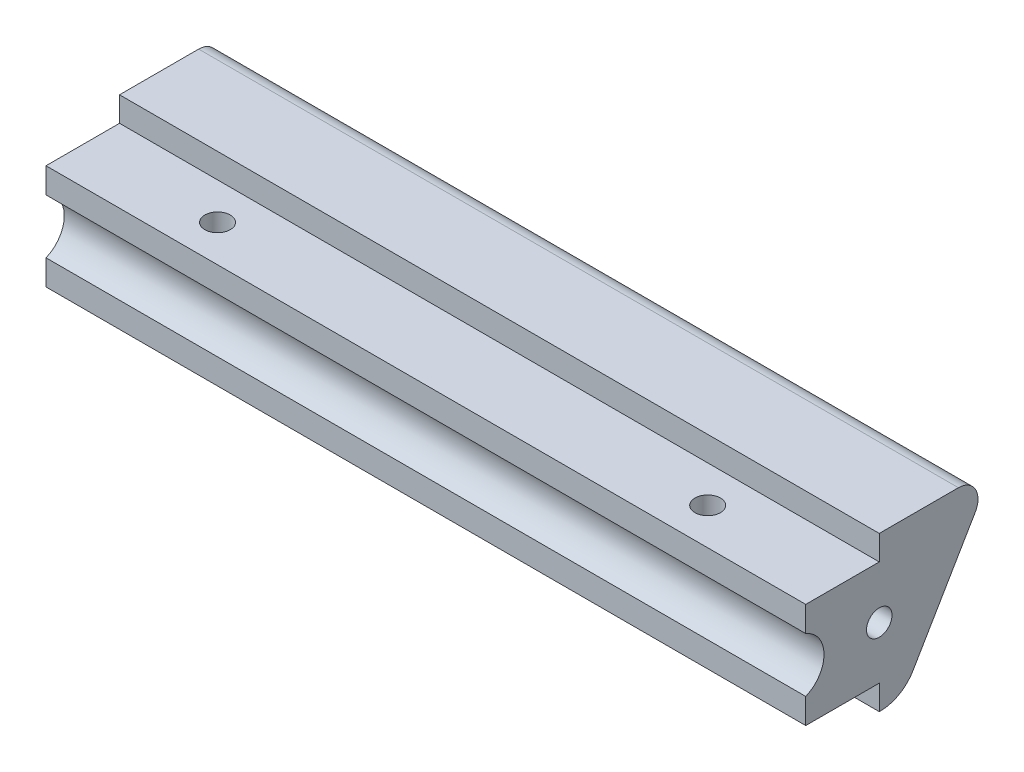
ISO-10303-21;
HEADER;
FILE_DESCRIPTION(('STEP AP214'),'2;1');
FILE_NAME('part.step','',(''),(''),'','','');
FILE_SCHEMA(('AUTOMOTIVE_DESIGN { 1 0 10303 214 1 1 1 1 }'));
ENDSEC;
DATA;
#1=APPLICATION_CONTEXT('core data for automotive mechanical design processes');
#2=APPLICATION_PROTOCOL_DEFINITION('international standard','automotive_design',2000,#1);
#3=PRODUCT_CONTEXT('',#1,'mechanical');
#4=PRODUCT('Part','Part','',(#3));
#5=PRODUCT_RELATED_PRODUCT_CATEGORY('part','',(#4));
#6=PRODUCT_DEFINITION_FORMATION('','',#4);
#7=PRODUCT_DEFINITION_CONTEXT('part definition',#1,'design');
#8=PRODUCT_DEFINITION('design','',#6,#7);
#9=PRODUCT_DEFINITION_SHAPE('','',#8);
#10=(LENGTH_UNIT() NAMED_UNIT(*) SI_UNIT(.MILLI.,.METRE.));
#11=(NAMED_UNIT(*) PLANE_ANGLE_UNIT() SI_UNIT($,.RADIAN.));
#12=(NAMED_UNIT(*) SI_UNIT($,.STERADIAN.) SOLID_ANGLE_UNIT());
#13=UNCERTAINTY_MEASURE_WITH_UNIT(LENGTH_MEASURE(1.E-05),#10,'distance_accuracy_value','');
#14=(GEOMETRIC_REPRESENTATION_CONTEXT(3) GLOBAL_UNCERTAINTY_ASSIGNED_CONTEXT((#13)) GLOBAL_UNIT_ASSIGNED_CONTEXT((#10,
#11,#12)) REPRESENTATION_CONTEXT('',''));
#15=CARTESIAN_POINT('',(0.,0.,0.));
#16=DIRECTION('',(0.,0.,1.));
#17=DIRECTION('',(1.,0.,0.));
#18=AXIS2_PLACEMENT_3D('',#15,#16,#17);
#19=CARTESIAN_POINT('',(98.425,16.7996,0.));
#20=DIRECTION('',(0.,0.,-1.));
#21=DIRECTION('',(0.,1.,0.));
#22=AXIS2_PLACEMENT_3D('',#19,#20,#21);
#23=PLANE('',#22);
#24=DIRECTION('',(0.,-1.,0.));
#25=VECTOR('',#24,1.);
#26=CARTESIAN_POINT('',(98.425,16.7996,0.));
#27=LINE('',#26,#25);
#28=CARTESIAN_POINT('',(98.425,6.4737188141613,0.));
#29=VERTEX_POINT('',#28);
#30=CARTESIAN_POINT('',(98.425,3.2004,0.));
#31=VERTEX_POINT('',#30);
#32=EDGE_CURVE('E137',#29,#31,#27,.T.);
#33=ORIENTED_EDGE('',*,*,#32,.F.);
#34=DIRECTION('',(-1.,0.,0.));
#35=VECTOR('',#34,1.);
#36=CARTESIAN_POINT('',(105.864264117156,6.4737188141613,0.));
#37=LINE('',#36,#35);
#38=CARTESIAN_POINT('',(0.,6.4737188141613,0.));
#39=VERTEX_POINT('',#38);
#40=EDGE_CURVE('E123',#29,#39,#37,.T.);
#41=ORIENTED_EDGE('',*,*,#40,.T.);
#42=DIRECTION('',(0.,-1.,0.));
#43=VECTOR('',#42,1.);
#44=CARTESIAN_POINT('',(0.,16.7996,0.));
#45=LINE('',#44,#43);
#46=CARTESIAN_POINT('',(0.,3.2004,0.));
#47=VERTEX_POINT('',#46);
#48=EDGE_CURVE('E135',#39,#47,#45,.T.);
#49=ORIENTED_EDGE('',*,*,#48,.T.);
#50=DIRECTION('',(-1.,0.,0.));
#51=VECTOR('',#50,1.);
#52=CARTESIAN_POINT('',(98.425,3.2004,0.));
#53=LINE('',#52,#51);
#54=EDGE_CURVE('E173',#31,#47,#53,.T.);
#55=ORIENTED_EDGE('',*,*,#54,.F.);
#56=EDGE_LOOP('',(#33,#41,#49,#55));
#57=FACE_BOUND('',#56,.T.);
#58=ADVANCED_FACE('F32',(#57),#23,.F.);
#59=CARTESIAN_POINT('',(98.425,20.,-24.2156234533446));
#60=DIRECTION('',(0.,-1.,0.));
#61=DIRECTION('',(0.,0.,-1.));
#62=AXIS2_PLACEMENT_3D('',#59,#60,#61);
#63=PLANE('',#62);
#64=DIRECTION('',(0.,0.,1.));
#65=VECTOR('',#64,1.);
#66=CARTESIAN_POINT('',(98.425,20.,-24.2156234533446));
#67=LINE('',#66,#65);
#68=CARTESIAN_POINT('',(98.425,20.,-19.7792045559382));
#69=VERTEX_POINT('',#68);
#70=CARTESIAN_POINT('',(98.425,20.,-9.525));
#71=VERTEX_POINT('',#70);
#72=EDGE_CURVE('E159',#69,#71,#67,.T.);
#73=ORIENTED_EDGE('',*,*,#72,.F.);
#74=DIRECTION('',(-1.,0.,0.));
#75=VECTOR('',#74,1.);
#76=CARTESIAN_POINT('',(98.425,20.,-19.7792045559382));
#77=LINE('',#76,#75);
#78=CARTESIAN_POINT('',(0.,20.,-19.7792045559382));
#79=VERTEX_POINT('',#78);
#80=EDGE_CURVE('E184',#69,#79,#77,.T.);
#81=ORIENTED_EDGE('',*,*,#80,.T.);
#82=DIRECTION('',(0.,0.,1.));
#83=VECTOR('',#82,1.);
#84=CARTESIAN_POINT('',(0.,20.,-24.2156234533446));
#85=LINE('',#84,#83);
#86=CARTESIAN_POINT('',(0.,20.,-9.525));
#87=VERTEX_POINT('',#86);
#88=EDGE_CURVE('E192',#79,#87,#85,.T.);
#89=ORIENTED_EDGE('',*,*,#88,.T.);
#90=DIRECTION('',(-1.,0.,0.));
#91=VECTOR('',#90,1.);
#92=CARTESIAN_POINT('',(98.425,20.,-9.525));
#93=LINE('',#92,#91);
#94=EDGE_CURVE('E181',#71,#87,#93,.T.);
#95=ORIENTED_EDGE('',*,*,#94,.F.);
#96=EDGE_LOOP('',(#73,#81,#89,#95));
#97=FACE_BOUND('',#96,.T.);
#98=ADVANCED_FACE('F190',(#97),#63,.F.);
#99=CARTESIAN_POINT('',(98.425,20.,-9.525));
#100=DIRECTION('',(0.,0.,-1.));
#101=DIRECTION('',(-1.,0.,0.));
#102=AXIS2_PLACEMENT_3D('',#99,#100,#101);
#103=PLANE('',#102);
#104=DIRECTION('',(0.,-1.,0.));
#105=VECTOR('',#104,1.);
#106=CARTESIAN_POINT('',(0.,20.,-9.525));
#107=LINE('',#106,#105);
#108=CARTESIAN_POINT('',(0.,16.7996,-9.525));
#109=VERTEX_POINT('',#108);
#110=EDGE_CURVE('E146',#87,#109,#107,.T.);
#111=ORIENTED_EDGE('',*,*,#110,.T.);
#112=DIRECTION('',(-1.,0.,0.));
#113=VECTOR('',#112,1.);
#114=CARTESIAN_POINT('',(98.425,16.7996,-9.525));
#115=LINE('',#114,#113);
#116=CARTESIAN_POINT('',(98.425,16.7996,-9.525));
#117=VERTEX_POINT('',#116);
#118=EDGE_CURVE('E178',#117,#109,#115,.T.);
#119=ORIENTED_EDGE('',*,*,#118,.F.);
#120=DIRECTION('',(0.,-1.,0.));
#121=VECTOR('',#120,1.);
#122=CARTESIAN_POINT('',(98.425,20.,-9.525));
#123=LINE('',#122,#121);
#124=EDGE_CURVE('E215',#71,#117,#123,.T.);
#125=ORIENTED_EDGE('',*,*,#124,.F.);
#126=ORIENTED_EDGE('',*,*,#94,.T.);
#127=EDGE_LOOP('',(#111,#119,#125,#126));
#128=FACE_BOUND('',#127,.T.);
#129=ADVANCED_FACE('F263',(#128),#103,.F.);
#130=CARTESIAN_POINT('',(98.425,16.7996,-9.525));
#131=DIRECTION('',(0.,-1.,0.));
#132=DIRECTION('',(0.,0.,-1.));
#133=AXIS2_PLACEMENT_3D('',#130,#131,#132);
#134=PLANE('',#133);
#135=CARTESIAN_POINT('',(17.4625,16.7996,-4.76250000000001));
#136=DIRECTION('',(0.,1.,0.));
#137=DIRECTION('',(0.,0.,1.));
#138=AXIS2_PLACEMENT_3D('',#135,#136,#137);
#139=CIRCLE('',#138,1.651);
#140=CARTESIAN_POINT('',(17.4625,16.7996,-3.11150000000001));
#141=VERTEX_POINT('',#140);
#142=EDGE_CURVE('E222',#141,#141,#139,.T.);
#143=ORIENTED_EDGE('',*,*,#142,.F.);
#144=EDGE_LOOP('',(#143));
#145=FACE_BOUND('',#144,.T.);
#146=CARTESIAN_POINT('',(80.9625,16.7996,-4.76250000000005));
#147=DIRECTION('',(0.,1.,0.));
#148=DIRECTION('',(0.,0.,1.));
#149=AXIS2_PLACEMENT_3D('',#146,#147,#148);
#150=CIRCLE('',#149,1.65100000000001);
#151=CARTESIAN_POINT('',(80.9625,16.7996,-3.11150000000004));
#152=VERTEX_POINT('',#151);
#153=EDGE_CURVE('E223',#152,#152,#150,.T.);
#154=ORIENTED_EDGE('',*,*,#153,.F.);
#155=EDGE_LOOP('',(#154));
#156=FACE_BOUND('',#155,.T.);
#157=DIRECTION('',(0.,0.,1.));
#158=VECTOR('',#157,1.);
#159=CARTESIAN_POINT('',(0.,16.7996,-9.525));
#160=LINE('',#159,#158);
#161=CARTESIAN_POINT('',(0.,16.7996,0.));
#162=VERTEX_POINT('',#161);
#163=EDGE_CURVE('E144',#109,#162,#160,.T.);
#164=ORIENTED_EDGE('',*,*,#163,.T.);
#165=DIRECTION('',(-1.,0.,0.));
#166=VECTOR('',#165,1.);
#167=CARTESIAN_POINT('',(98.425,16.7996,0.));
#168=LINE('',#167,#166);
#169=CARTESIAN_POINT('',(98.425,16.7996,0.));
#170=VERTEX_POINT('',#169);
#171=EDGE_CURVE('E175',#170,#162,#168,.T.);
#172=ORIENTED_EDGE('',*,*,#171,.F.);
#173=DIRECTION('',(0.,0.,1.));
#174=VECTOR('',#173,1.);
#175=CARTESIAN_POINT('',(98.425,16.7996,-9.525));
#176=LINE('',#175,#174);
#177=EDGE_CURVE('E213',#117,#170,#176,.T.);
#178=ORIENTED_EDGE('',*,*,#177,.F.);
#179=ORIENTED_EDGE('',*,*,#118,.T.);
#180=EDGE_LOOP('',(#164,#172,#178,#179));
#181=FACE_BOUND('',#180,.T.);
#182=ADVANCED_FACE('F268',(#145,#156,#181),#134,.F.);
#183=CARTESIAN_POINT('',(0.,13.5262811858387,0.));
#184=VERTEX_POINT('',#183);
#185=EDGE_CURVE('E143',#162,#184,#45,.T.);
#186=ORIENTED_EDGE('',*,*,#185,.T.);
#187=DIRECTION('',(-1.,0.,0.));
#188=VECTOR('',#187,1.);
#189=CARTESIAN_POINT('',(105.864264117156,13.5262811858387,0.));
#190=LINE('',#189,#188);
#191=CARTESIAN_POINT('',(98.425,13.5262811858387,0.));
#192=VERTEX_POINT('',#191);
#193=EDGE_CURVE('E126',#192,#184,#190,.T.);
#194=ORIENTED_EDGE('',*,*,#193,.F.);
#195=EDGE_CURVE('E210',#170,#192,#27,.T.);
#196=ORIENTED_EDGE('',*,*,#195,.F.);
#197=ORIENTED_EDGE('',*,*,#171,.T.);
#198=EDGE_LOOP('',(#186,#194,#196,#197));
#199=FACE_BOUND('',#198,.T.);
#200=ADVANCED_FACE('F259',(#199),#23,.F.);
#201=CARTESIAN_POINT('',(98.425,3.2004,0.));
#202=DIRECTION('',(0.,1.,0.));
#203=DIRECTION('',(0.,0.,1.));
#204=AXIS2_PLACEMENT_3D('',#201,#202,#203);
#205=PLANE('',#204);
#206=CARTESIAN_POINT('',(17.4625,3.2004,-4.76250000000001));
#207=DIRECTION('',(0.,1.,0.));
#208=DIRECTION('',(0.,0.,1.));
#209=AXIS2_PLACEMENT_3D('',#206,#207,#208);
#210=CIRCLE('',#209,1.651);
#211=CARTESIAN_POINT('',(17.4625,3.2004,-3.11150000000001));
#212=VERTEX_POINT('',#211);
#213=EDGE_CURVE('E130',#212,#212,#210,.F.);
#214=ORIENTED_EDGE('',*,*,#213,.F.);
#215=EDGE_LOOP('',(#214));
#216=FACE_BOUND('',#215,.T.);
#217=CARTESIAN_POINT('',(80.9625,3.2004,-4.76250000000005));
#218=DIRECTION('',(0.,1.,0.));
#219=DIRECTION('',(0.,0.,1.));
#220=AXIS2_PLACEMENT_3D('',#217,#218,#219);
#221=CIRCLE('',#220,1.65100000000001);
#222=CARTESIAN_POINT('',(80.9625,3.2004,-3.11150000000005));
#223=VERTEX_POINT('',#222);
#224=EDGE_CURVE('E219',#223,#223,#221,.F.);
#225=ORIENTED_EDGE('',*,*,#224,.F.);
#226=EDGE_LOOP('',(#225));
#227=FACE_BOUND('',#226,.T.);
#228=DIRECTION('',(0.,0.,-1.));
#229=VECTOR('',#228,1.);
#230=CARTESIAN_POINT('',(0.,3.2004,0.));
#231=LINE('',#230,#229);
#232=CARTESIAN_POINT('',(0.,3.2004,-9.525));
#233=VERTEX_POINT('',#232);
#234=EDGE_CURVE('E142',#47,#233,#231,.T.);
#235=ORIENTED_EDGE('',*,*,#234,.T.);
#236=DIRECTION('',(-1.,0.,0.));
#237=VECTOR('',#236,1.);
#238=CARTESIAN_POINT('',(98.425,3.2004,-9.525));
#239=LINE('',#238,#237);
#240=CARTESIAN_POINT('',(98.425,3.2004,-9.525));
#241=VERTEX_POINT('',#240);
#242=EDGE_CURVE('E170',#241,#233,#239,.T.);
#243=ORIENTED_EDGE('',*,*,#242,.F.);
#244=DIRECTION('',(0.,0.,-1.));
#245=VECTOR('',#244,1.);
#246=CARTESIAN_POINT('',(98.425,3.2004,0.));
#247=LINE('',#246,#245);
#248=EDGE_CURVE('E208',#31,#241,#247,.T.);
#249=ORIENTED_EDGE('',*,*,#248,.F.);
#250=ORIENTED_EDGE('',*,*,#54,.T.);
#251=EDGE_LOOP('',(#235,#243,#249,#250));
#252=FACE_BOUND('',#251,.T.);
#253=ADVANCED_FACE('F267',(#216,#227,#252),#205,.F.);
#254=CARTESIAN_POINT('',(98.425,3.2004,-9.525));
#255=DIRECTION('',(0.,0.,-1.));
#256=DIRECTION('',(0.,1.,0.));
#257=AXIS2_PLACEMENT_3D('',#254,#255,#256);
#258=PLANE('',#257);
#259=DIRECTION('',(0.,-1.,0.));
#260=VECTOR('',#259,1.);
#261=CARTESIAN_POINT('',(0.,3.2004,-9.525));
#262=LINE('',#261,#260);
#263=CARTESIAN_POINT('',(0.,0.,-9.525));
#264=VERTEX_POINT('',#263);
#265=EDGE_CURVE('E151',#233,#264,#262,.T.);
#266=ORIENTED_EDGE('',*,*,#265,.T.);
#267=DIRECTION('',(-1.,0.,0.));
#268=VECTOR('',#267,1.);
#269=CARTESIAN_POINT('',(98.425,0.,-9.525));
#270=LINE('',#269,#268);
#271=CARTESIAN_POINT('',(98.425,0.,-9.525));
#272=VERTEX_POINT('',#271);
#273=EDGE_CURVE('E167',#272,#264,#270,.T.);
#274=ORIENTED_EDGE('',*,*,#273,.F.);
#275=DIRECTION('',(0.,-1.,0.));
#276=VECTOR('',#275,1.);
#277=CARTESIAN_POINT('',(98.425,3.2004,-9.525));
#278=LINE('',#277,#276);
#279=EDGE_CURVE('E206',#241,#272,#278,.T.);
#280=ORIENTED_EDGE('',*,*,#279,.F.);
#281=ORIENTED_EDGE('',*,*,#242,.T.);
#282=EDGE_LOOP('',(#266,#274,#280,#281));
#283=FACE_BOUND('',#282,.T.);
#284=ADVANCED_FACE('F274',(#283),#258,.F.);
#285=CARTESIAN_POINT('',(98.425,0.,-9.67200120834093));
#286=DIRECTION('',(0.,1.,0.));
#287=DIRECTION('',(0.,0.,1.));
#288=AXIS2_PLACEMENT_3D('',#285,#286,#287);
#289=PLANE('',#288);
#290=DIRECTION('',(0.,0.,-1.));
#291=VECTOR('',#290,1.);
#292=CARTESIAN_POINT('',(0.,0.,-9.67200120834093));
#293=LINE('',#292,#291);
#294=CARTESIAN_POINT('',(0.,0.,-9.67200120834093));
#295=VERTEX_POINT('',#294);
#296=EDGE_CURVE('E153',#264,#295,#293,.T.);
#297=ORIENTED_EDGE('',*,*,#296,.T.);
#298=DIRECTION('',(-1.,0.,0.));
#299=VECTOR('',#298,1.);
#300=CARTESIAN_POINT('',(98.425,0.,-9.67200120834093));
#301=LINE('',#300,#299);
#302=CARTESIAN_POINT('',(98.425,0.,-9.67200120834093));
#303=VERTEX_POINT('',#302);
#304=EDGE_CURVE('E163',#303,#295,#301,.T.);
#305=ORIENTED_EDGE('',*,*,#304,.F.);
#306=DIRECTION('',(0.,0.,-1.));
#307=VECTOR('',#306,1.);
#308=CARTESIAN_POINT('',(98.425,0.,-9.67200120834093));
#309=LINE('',#308,#307);
#310=EDGE_CURVE('E204',#272,#303,#309,.T.);
#311=ORIENTED_EDGE('',*,*,#310,.F.);
#312=ORIENTED_EDGE('',*,*,#273,.T.);
#313=EDGE_LOOP('',(#297,#305,#311,#312));
#314=FACE_BOUND('',#313,.T.);
#315=ADVANCED_FACE('F293',(#314),#289,.F.);
#316=CARTESIAN_POINT('',(98.425,4.89533435134192,-9.67200120834093));
#317=DIRECTION('',(-1.,0.,0.));
#318=DIRECTION('',(0.,0.,1.));
#319=AXIS2_PLACEMENT_3D('',#316,#317,#318);
#320=CYLINDRICAL_SURFACE('',#319,4.89533435134192);
#321=CARTESIAN_POINT('',(0.,4.89533435134192,-9.67200120834093));
#322=DIRECTION('',(1.,0.,0.));
#323=DIRECTION('',(0.,0.,1.));
#324=AXIS2_PLACEMENT_3D('',#321,#322,#323);
#325=CIRCLE('',#324,4.89533435134192);
#326=CARTESIAN_POINT('',(0.,2.4170390254288,-13.893653809987));
#327=VERTEX_POINT('',#326);
#328=EDGE_CURVE('E155',#295,#327,#325,.T.);
#329=ORIENTED_EDGE('',*,*,#328,.T.);
#330=DIRECTION('',(-1.,0.,0.));
#331=VECTOR('',#330,1.);
#332=CARTESIAN_POINT('',(98.425,2.4170390254288,-13.893653809987));
#333=LINE('',#332,#331);
#334=CARTESIAN_POINT('',(98.425,2.4170390254288,-13.893653809987));
#335=VERTEX_POINT('',#334);
#336=EDGE_CURVE('E160',#335,#327,#333,.T.);
#337=ORIENTED_EDGE('',*,*,#336,.F.);
#338=CARTESIAN_POINT('',(98.425,4.89533435134192,-9.67200120834093));
#339=DIRECTION('',(1.,0.,0.));
#340=DIRECTION('',(0.,0.,1.));
#341=AXIS2_PLACEMENT_3D('',#338,#339,#340);
#342=CIRCLE('',#341,4.89533435134192);
#343=EDGE_CURVE('E202',#303,#335,#342,.T.);
#344=ORIENTED_EDGE('',*,*,#343,.F.);
#345=ORIENTED_EDGE('',*,*,#304,.T.);
#346=EDGE_LOOP('',(#329,#337,#344,#345));
#347=FACE_BOUND('',#346,.T.);
#348=ADVANCED_FACE('F297',(#347),#320,.T.);
#349=CARTESIAN_POINT('',(98.425,20.,-24.2156234533446));
#350=DIRECTION('',(0.,0.506256600273639,0.862382893313276));
#351=DIRECTION('',(0.,-0.862382893313276,0.506256600273639));
#352=AXIS2_PLACEMENT_3D('',#349,#350,#351);
#353=PLANE('',#352);
#354=DIRECTION('',(0.,0.862382893313276,-0.506256600273639));
#355=VECTOR('',#354,1.);
#356=CARTESIAN_POINT('',(0.,20.,-24.2156234533446));
#357=LINE('',#356,#355);
#358=CARTESIAN_POINT('',(0.,16.174108235305,-21.9696571049539));
#359=VERTEX_POINT('',#358);
#360=EDGE_CURVE('E157',#327,#359,#357,.T.);
#361=ORIENTED_EDGE('',*,*,#360,.T.);
#362=DIRECTION('',(-1.,0.,0.));
#363=VECTOR('',#362,1.);
#364=CARTESIAN_POINT('',(98.425,16.174108235305,-21.9696571049539));
#365=LINE('',#364,#363);
#366=CARTESIAN_POINT('',(98.425,16.174108235305,-21.9696571049539));
#367=VERTEX_POINT('',#366);
#368=EDGE_CURVE('E40',#359,#367,#365,.F.);
#369=ORIENTED_EDGE('',*,*,#368,.T.);
#370=DIRECTION('',(0.,0.862382893313276,-0.506256600273639));
#371=VECTOR('',#370,1.);
#372=CARTESIAN_POINT('',(98.425,20.,-24.2156234533446));
#373=LINE('',#372,#371);
#374=EDGE_CURVE('E164',#335,#367,#373,.T.);
#375=ORIENTED_EDGE('',*,*,#374,.F.);
#376=ORIENTED_EDGE('',*,*,#336,.T.);
#377=EDGE_LOOP('',(#361,#369,#375,#376));
#378=FACE_BOUND('',#377,.T.);
#379=ADVANCED_FACE('F243',(#378),#353,.F.);
#380=CARTESIAN_POINT('',(98.425,4.89533435134192,-9.67200120834093));
#381=DIRECTION('',(-1.,0.,0.));
#382=DIRECTION('',(0.,0.,1.));
#383=AXIS2_PLACEMENT_3D('',#380,#381,#382);
#384=PLANE('',#383);
#385=CARTESIAN_POINT('',(98.425,10.,-9.525));
#386=DIRECTION('',(1.,0.,0.));
#387=DIRECTION('',(0.,0.,-1.));
#388=AXIS2_PLACEMENT_3D('',#385,#386,#387);
#389=CIRCLE('',#388,1.651);
#390=CARTESIAN_POINT('',(98.425,10.,-11.176));
#391=VERTEX_POINT('',#390);
#392=EDGE_CURVE('E233',#391,#391,#389,.T.);
#393=ORIENTED_EDGE('',*,*,#392,.F.);
#394=EDGE_LOOP('',(#393));
#395=FACE_BOUND('',#394,.T.);
#396=ORIENTED_EDGE('',*,*,#374,.T.);
#397=CARTESIAN_POINT('',(98.425,17.46,-19.7792045559382));
#398=DIRECTION('',(-1.,0.,0.));
#399=DIRECTION('',(0.,0.,1.));
#400=AXIS2_PLACEMENT_3D('',#397,#398,#399);
#401=CIRCLE('',#400,2.54);
#402=EDGE_CURVE('E11',#367,#69,#401,.F.);
#403=ORIENTED_EDGE('',*,*,#402,.T.);
#404=ORIENTED_EDGE('',*,*,#72,.T.);
#405=ORIENTED_EDGE('',*,*,#124,.T.);
#406=ORIENTED_EDGE('',*,*,#177,.T.);
#407=ORIENTED_EDGE('',*,*,#195,.T.);
#408=CARTESIAN_POINT('',(98.425,10.,1.44272));
#409=DIRECTION('',(-1.,0.,0.));
#410=DIRECTION('',(0.,0.,1.));
#411=AXIS2_PLACEMENT_3D('',#408,#409,#410);
#412=CIRCLE('',#411,3.81);
#413=EDGE_CURVE('E197',#29,#192,#412,.F.);
#414=ORIENTED_EDGE('',*,*,#413,.F.);
#415=ORIENTED_EDGE('',*,*,#32,.T.);
#416=ORIENTED_EDGE('',*,*,#248,.T.);
#417=ORIENTED_EDGE('',*,*,#279,.T.);
#418=ORIENTED_EDGE('',*,*,#310,.T.);
#419=ORIENTED_EDGE('',*,*,#343,.T.);
#420=EDGE_LOOP('',(#396,#403,#404,#405,#406,#407,#414,#415,#416,#417,#418,#419));
#421=FACE_BOUND('',#420,.T.);
#422=ADVANCED_FACE('F240',(#395,#421),#384,.F.);
#423=CARTESIAN_POINT('',(0.,4.89533435134192,-9.67200120834093));
#424=DIRECTION('',(-1.,0.,0.));
#425=DIRECTION('',(0.,0.,1.));
#426=AXIS2_PLACEMENT_3D('',#423,#424,#425);
#427=PLANE('',#426);
#428=CARTESIAN_POINT('',(0.,10.,-9.525));
#429=DIRECTION('',(-1.,0.,0.));
#430=DIRECTION('',(0.,0.,1.));
#431=AXIS2_PLACEMENT_3D('',#428,#429,#430);
#432=CIRCLE('',#431,1.651);
#433=CARTESIAN_POINT('',(0.,10.,-7.874));
#434=VERTEX_POINT('',#433);
#435=EDGE_CURVE('E226',#434,#434,#432,.F.);
#436=ORIENTED_EDGE('',*,*,#435,.T.);
#437=EDGE_LOOP('',(#436));
#438=FACE_BOUND('',#437,.T.);
#439=ORIENTED_EDGE('',*,*,#88,.F.);
#440=CARTESIAN_POINT('',(0.,17.46,-19.7792045559382));
#441=DIRECTION('',(-1.,0.,0.));
#442=DIRECTION('',(0.,0.,1.));
#443=AXIS2_PLACEMENT_3D('',#440,#441,#442);
#444=CIRCLE('',#443,2.54);
#445=EDGE_CURVE('E54',#79,#359,#444,.T.);
#446=ORIENTED_EDGE('',*,*,#445,.T.);
#447=ORIENTED_EDGE('',*,*,#360,.F.);
#448=ORIENTED_EDGE('',*,*,#328,.F.);
#449=ORIENTED_EDGE('',*,*,#296,.F.);
#450=ORIENTED_EDGE('',*,*,#265,.F.);
#451=ORIENTED_EDGE('',*,*,#234,.F.);
#452=ORIENTED_EDGE('',*,*,#48,.F.);
#453=CARTESIAN_POINT('',(0.,10.,1.44272));
#454=DIRECTION('',(-1.,0.,0.));
#455=DIRECTION('',(0.,0.,1.));
#456=AXIS2_PLACEMENT_3D('',#453,#454,#455);
#457=CIRCLE('',#456,3.81);
#458=EDGE_CURVE('E120',#184,#39,#457,.T.);
#459=ORIENTED_EDGE('',*,*,#458,.F.);
#460=ORIENTED_EDGE('',*,*,#185,.F.);
#461=ORIENTED_EDGE('',*,*,#163,.F.);
#462=ORIENTED_EDGE('',*,*,#110,.F.);
#463=EDGE_LOOP('',(#439,#446,#447,#448,#449,#450,#451,#452,#459,#460,#461,#462));
#464=FACE_BOUND('',#463,.T.);
#465=ADVANCED_FACE('F140',(#438,#464),#427,.T.);
#466=CARTESIAN_POINT('',(105.864264117156,10.,1.44272));
#467=DIRECTION('',(-1.,0.,0.));
#468=DIRECTION('',(0.,0.,1.));
#469=AXIS2_PLACEMENT_3D('',#466,#467,#468);
#470=CYLINDRICAL_SURFACE('',#469,3.81);
#471=ORIENTED_EDGE('',*,*,#413,.T.);
#472=ORIENTED_EDGE('',*,*,#193,.T.);
#473=ORIENTED_EDGE('',*,*,#458,.T.);
#474=ORIENTED_EDGE('',*,*,#40,.F.);
#475=EDGE_LOOP('',(#471,#472,#473,#474));
#476=FACE_BOUND('',#475,.T.);
#477=ADVANCED_FACE('F122',(#476),#470,.F.);
#478=CARTESIAN_POINT('',(80.9625,-1.46933318295597,-4.76250000000005));
#479=DIRECTION('',(0.,1.,0.));
#480=DIRECTION('',(0.,0.,1.));
#481=AXIS2_PLACEMENT_3D('',#478,#479,#480);
#482=CYLINDRICAL_SURFACE('',#481,1.65100000000001);
#483=ORIENTED_EDGE('',*,*,#224,.T.);
#484=EDGE_LOOP('',(#483));
#485=FACE_BOUND('',#484,.T.);
#486=ORIENTED_EDGE('',*,*,#153,.T.);
#487=EDGE_LOOP('',(#486));
#488=FACE_BOUND('',#487,.T.);
#489=ADVANCED_FACE('F254',(#485,#488),#482,.F.);
#490=CARTESIAN_POINT('',(17.4625,-1.46933318295597,-4.76250000000001));
#491=DIRECTION('',(0.,1.,0.));
#492=DIRECTION('',(0.,0.,1.));
#493=AXIS2_PLACEMENT_3D('',#490,#491,#492);
#494=CYLINDRICAL_SURFACE('',#493,1.651);
#495=ORIENTED_EDGE('',*,*,#213,.T.);
#496=EDGE_LOOP('',(#495));
#497=FACE_BOUND('',#496,.T.);
#498=ORIENTED_EDGE('',*,*,#142,.T.);
#499=EDGE_LOOP('',(#498));
#500=FACE_BOUND('',#499,.T.);
#501=ADVANCED_FACE('F248',(#497,#500),#494,.F.);
#502=CARTESIAN_POINT('',(98.425,17.46,-19.7792045559382));
#503=DIRECTION('',(-1.,0.,0.));
#504=DIRECTION('',(0.,0.,1.));
#505=AXIS2_PLACEMENT_3D('',#502,#503,#504);
#506=CYLINDRICAL_SURFACE('',#505,2.54);
#507=ORIENTED_EDGE('',*,*,#402,.F.);
#508=ORIENTED_EDGE('',*,*,#368,.F.);
#509=ORIENTED_EDGE('',*,*,#445,.F.);
#510=ORIENTED_EDGE('',*,*,#80,.F.);
#511=EDGE_LOOP('',(#507,#508,#509,#510));
#512=FACE_BOUND('',#511,.T.);
#513=ADVANCED_FACE('F34',(#512),#506,.T.);
#514=CARTESIAN_POINT('',(-4.66973318295596,10.,-9.525));
#515=DIRECTION('',(1.,0.,0.));
#516=DIRECTION('',(0.,0.,-1.));
#517=AXIS2_PLACEMENT_3D('',#514,#515,#516);
#518=CYLINDRICAL_SURFACE('',#517,1.651);
#519=ORIENTED_EDGE('',*,*,#392,.T.);
#520=EDGE_LOOP('',(#519));
#521=FACE_BOUND('',#520,.T.);
#522=ORIENTED_EDGE('',*,*,#435,.F.);
#523=EDGE_LOOP('',(#522));
#524=FACE_BOUND('',#523,.T.);
#525=ADVANCED_FACE('F237',(#521,#524),#518,.F.);
#526=CLOSED_SHELL('',(#58,#98,#129,#182,#200,#253,#284,#315,#348,#379,#422,#465,#477,#489,#501,
#513,#525));
#527=MANIFOLD_SOLID_BREP('B2',#526);
#528=ADVANCED_BREP_SHAPE_REPRESENTATION('',(#18,#527),#14);
#529=SHAPE_DEFINITION_REPRESENTATION(#9,#528);
ENDSEC;
END-ISO-10303-21;
